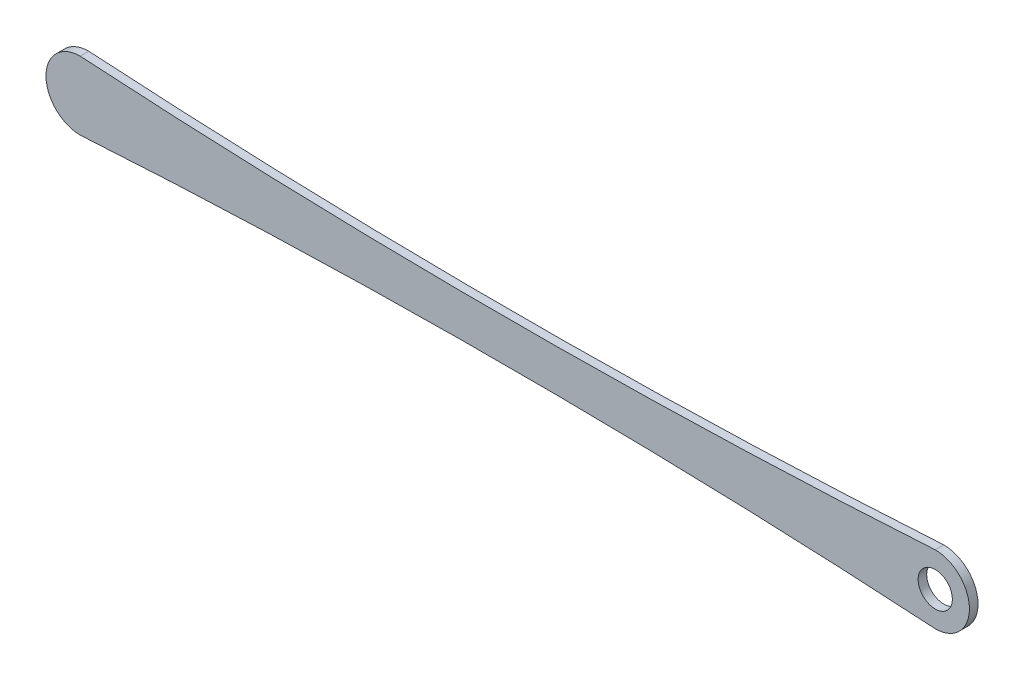
ISO-10303-21;
HEADER;
FILE_DESCRIPTION(('STEP AP214'),'2;1');
FILE_NAME('part.step','',(''),(''),'','','');
FILE_SCHEMA(('AUTOMOTIVE_DESIGN { 1 0 10303 214 1 1 1 1 }'));
ENDSEC;
DATA;
#1=APPLICATION_CONTEXT('core data for automotive mechanical design processes');
#2=APPLICATION_PROTOCOL_DEFINITION('international standard','automotive_design',2000,#1);
#3=PRODUCT_CONTEXT('',#1,'mechanical');
#4=PRODUCT('Part','Part','',(#3));
#5=PRODUCT_RELATED_PRODUCT_CATEGORY('part','',(#4));
#6=PRODUCT_DEFINITION_FORMATION('','',#4);
#7=PRODUCT_DEFINITION_CONTEXT('part definition',#1,'design');
#8=PRODUCT_DEFINITION('design','',#6,#7);
#9=PRODUCT_DEFINITION_SHAPE('','',#8);
#10=(LENGTH_UNIT() NAMED_UNIT(*) SI_UNIT(.MILLI.,.METRE.));
#11=(NAMED_UNIT(*) PLANE_ANGLE_UNIT() SI_UNIT($,.RADIAN.));
#12=(NAMED_UNIT(*) SI_UNIT($,.STERADIAN.) SOLID_ANGLE_UNIT());
#13=UNCERTAINTY_MEASURE_WITH_UNIT(LENGTH_MEASURE(1.E-05),#10,'distance_accuracy_value','');
#14=(GEOMETRIC_REPRESENTATION_CONTEXT(3) GLOBAL_UNCERTAINTY_ASSIGNED_CONTEXT((#13)) GLOBAL_UNIT_ASSIGNED_CONTEXT((#10,
#11,#12)) REPRESENTATION_CONTEXT('',''));
#15=CARTESIAN_POINT('',(0.,0.,0.));
#16=DIRECTION('',(0.,0.,1.));
#17=DIRECTION('',(1.,0.,0.));
#18=AXIS2_PLACEMENT_3D('',#15,#16,#17);
#19=CARTESIAN_POINT('',(-9.97681353911284E-13,20060.8992783391,25.));
#20=DIRECTION('',(0.,0.,-1.));
#21=DIRECTION('',(-1.,0.,0.));
#22=AXIS2_PLACEMENT_3D('',#19,#20,#21);
#23=CYLINDRICAL_SURFACE('',#22,20000.);
#24=CARTESIAN_POINT('',(-9.97681353911284E-13,20060.8992783391,0.));
#25=DIRECTION('',(0.,0.,-1.));
#26=DIRECTION('',(1.,0.,0.));
#27=AXIS2_PLACEMENT_3D('',#24,#25,#26);
#28=CIRCLE('',#27,20000.);
#29=CARTESIAN_POINT('',(1250.,99.9999999999999,0.));
#30=VERTEX_POINT('',#29);
#31=CARTESIAN_POINT('',(-1250.,100.,0.));
#32=VERTEX_POINT('',#31);
#33=EDGE_CURVE('E101',#30,#32,#28,.T.);
#34=ORIENTED_EDGE('',*,*,#33,.T.);
#35=DIRECTION('',(0.,0.,-1.));
#36=VECTOR('',#35,1.);
#37=CARTESIAN_POINT('',(-1250.,100.,25.));
#38=LINE('',#37,#36);
#39=CARTESIAN_POINT('',(-1250.,100.,25.));
#40=VERTEX_POINT('',#39);
#41=EDGE_CURVE('E43',#40,#32,#38,.T.);
#42=ORIENTED_EDGE('',*,*,#41,.F.);
#43=CARTESIAN_POINT('',(-9.97681353911284E-13,20060.8992783391,25.));
#44=DIRECTION('',(0.,0.,-1.));
#45=DIRECTION('',(1.,0.,0.));
#46=AXIS2_PLACEMENT_3D('',#43,#44,#45);
#47=CIRCLE('',#46,20000.);
#48=CARTESIAN_POINT('',(1250.,99.9999999999999,25.));
#49=VERTEX_POINT('',#48);
#50=EDGE_CURVE('E87',#49,#40,#47,.T.);
#51=ORIENTED_EDGE('',*,*,#50,.F.);
#52=DIRECTION('',(0.,0.,-1.));
#53=VECTOR('',#52,1.);
#54=CARTESIAN_POINT('',(1250.,99.9999999999999,25.));
#55=LINE('',#54,#53);
#56=EDGE_CURVE('E97',#49,#30,#55,.T.);
#57=ORIENTED_EDGE('',*,*,#56,.T.);
#58=EDGE_LOOP('',(#34,#42,#51,#57));
#59=FACE_BOUND('',#58,.T.);
#60=ADVANCED_FACE('F35',(#59),#23,.F.);
#61=CARTESIAN_POINT('',(-1250.,0.,25.));
#62=DIRECTION('',(0.,0.,-1.));
#63=DIRECTION('',(-1.,0.,0.));
#64=AXIS2_PLACEMENT_3D('',#61,#62,#63);
#65=CYLINDRICAL_SURFACE('',#64,100.);
#66=CARTESIAN_POINT('',(-1250.,0.,0.));
#67=DIRECTION('',(0.,0.,1.));
#68=DIRECTION('',(1.,0.,0.));
#69=AXIS2_PLACEMENT_3D('',#66,#67,#68);
#70=CIRCLE('',#69,100.);
#71=CARTESIAN_POINT('',(-1250.,-100.000000000001,0.));
#72=VERTEX_POINT('',#71);
#73=EDGE_CURVE('E92',#32,#72,#70,.T.);
#74=ORIENTED_EDGE('',*,*,#73,.T.);
#75=DIRECTION('',(0.,0.,-1.));
#76=VECTOR('',#75,1.);
#77=CARTESIAN_POINT('',(-1250.,-100.000000000001,25.));
#78=LINE('',#77,#76);
#79=CARTESIAN_POINT('',(-1250.,-100.000000000001,25.));
#80=VERTEX_POINT('',#79);
#81=EDGE_CURVE('E90',#80,#72,#78,.T.);
#82=ORIENTED_EDGE('',*,*,#81,.F.);
#83=CARTESIAN_POINT('',(-1250.,0.,25.));
#84=DIRECTION('',(0.,0.,1.));
#85=DIRECTION('',(1.,0.,0.));
#86=AXIS2_PLACEMENT_3D('',#83,#84,#85);
#87=CIRCLE('',#86,100.);
#88=EDGE_CURVE('E82',#40,#80,#87,.T.);
#89=ORIENTED_EDGE('',*,*,#88,.F.);
#90=ORIENTED_EDGE('',*,*,#41,.T.);
#91=EDGE_LOOP('',(#74,#82,#89,#90));
#92=FACE_BOUND('',#91,.T.);
#93=ADVANCED_FACE('F91',(#92),#65,.T.);
#94=CARTESIAN_POINT('',(-9.97681353911284E-13,-20060.8992783391,25.));
#95=DIRECTION('',(0.,0.,-1.));
#96=DIRECTION('',(-1.,0.,0.));
#97=AXIS2_PLACEMENT_3D('',#94,#95,#96);
#98=CYLINDRICAL_SURFACE('',#97,20000.);
#99=CARTESIAN_POINT('',(-9.97681353911284E-13,-20060.8992783391,0.));
#100=DIRECTION('',(0.,0.,-1.));
#101=DIRECTION('',(-1.,0.,0.));
#102=AXIS2_PLACEMENT_3D('',#99,#100,#101);
#103=CIRCLE('',#102,20000.);
#104=CARTESIAN_POINT('',(1250.,-100.,0.));
#105=VERTEX_POINT('',#104);
#106=EDGE_CURVE('E68',#72,#105,#103,.T.);
#107=ORIENTED_EDGE('',*,*,#106,.T.);
#108=DIRECTION('',(0.,0.,-1.));
#109=VECTOR('',#108,1.);
#110=CARTESIAN_POINT('',(1250.,-100.,25.));
#111=LINE('',#110,#109);
#112=CARTESIAN_POINT('',(1250.,-100.,25.));
#113=VERTEX_POINT('',#112);
#114=EDGE_CURVE('E93',#113,#105,#111,.T.);
#115=ORIENTED_EDGE('',*,*,#114,.F.);
#116=CARTESIAN_POINT('',(-9.97681353911284E-13,-20060.8992783391,25.));
#117=DIRECTION('',(0.,0.,-1.));
#118=DIRECTION('',(-1.,0.,0.));
#119=AXIS2_PLACEMENT_3D('',#116,#117,#118);
#120=CIRCLE('',#119,20000.);
#121=EDGE_CURVE('E85',#80,#113,#120,.T.);
#122=ORIENTED_EDGE('',*,*,#121,.F.);
#123=ORIENTED_EDGE('',*,*,#81,.T.);
#124=EDGE_LOOP('',(#107,#115,#122,#123));
#125=FACE_BOUND('',#124,.T.);
#126=ADVANCED_FACE('F95',(#125),#98,.F.);
#127=CARTESIAN_POINT('',(1250.,0.,25.));
#128=DIRECTION('',(0.,0.,-1.));
#129=DIRECTION('',(-1.,0.,0.));
#130=AXIS2_PLACEMENT_3D('',#127,#128,#129);
#131=CYLINDRICAL_SURFACE('',#130,99.9999999999999);
#132=CARTESIAN_POINT('',(1250.,0.,0.));
#133=DIRECTION('',(0.,0.,1.));
#134=DIRECTION('',(1.,0.,0.));
#135=AXIS2_PLACEMENT_3D('',#132,#133,#134);
#136=CIRCLE('',#135,99.9999999999999);
#137=EDGE_CURVE('E74',#105,#30,#136,.T.);
#138=ORIENTED_EDGE('',*,*,#137,.T.);
#139=ORIENTED_EDGE('',*,*,#56,.F.);
#140=CARTESIAN_POINT('',(1250.,0.,25.));
#141=DIRECTION('',(0.,0.,1.));
#142=DIRECTION('',(1.,0.,0.));
#143=AXIS2_PLACEMENT_3D('',#140,#141,#142);
#144=CIRCLE('',#143,99.9999999999999);
#145=EDGE_CURVE('E51',#113,#49,#144,.T.);
#146=ORIENTED_EDGE('',*,*,#145,.F.);
#147=ORIENTED_EDGE('',*,*,#114,.T.);
#148=EDGE_LOOP('',(#138,#139,#146,#147));
#149=FACE_BOUND('',#148,.T.);
#150=ADVANCED_FACE('F124',(#149),#131,.T.);
#151=CARTESIAN_POINT('',(624.999999999999,10030.4496391696,25.));
#152=DIRECTION('',(0.,0.,1.));
#153=DIRECTION('',(1.,0.,0.));
#154=AXIS2_PLACEMENT_3D('',#151,#152,#153);
#155=PLANE('',#154);
#156=CARTESIAN_POINT('',(1250.,0.,25.));
#157=DIRECTION('',(0.,0.,1.));
#158=DIRECTION('',(-1.,0.,0.));
#159=AXIS2_PLACEMENT_3D('',#156,#157,#158);
#160=CIRCLE('',#159,50.);
#161=CARTESIAN_POINT('',(1200.,0.,25.));
#162=VERTEX_POINT('',#161);
#163=EDGE_CURVE('E184',#162,#162,#160,.T.);
#164=ORIENTED_EDGE('',*,*,#163,.F.);
#165=EDGE_LOOP('',(#164));
#166=FACE_BOUND('',#165,.T.);
#167=ORIENTED_EDGE('',*,*,#50,.T.);
#168=ORIENTED_EDGE('',*,*,#88,.T.);
#169=ORIENTED_EDGE('',*,*,#121,.T.);
#170=ORIENTED_EDGE('',*,*,#145,.T.);
#171=EDGE_LOOP('',(#167,#168,#169,#170));
#172=FACE_BOUND('',#171,.T.);
#173=ADVANCED_FACE('F83',(#166,#172),#155,.T.);
#174=CARTESIAN_POINT('',(624.999999999999,10030.4496391696,0.));
#175=DIRECTION('',(0.,0.,1.));
#176=DIRECTION('',(1.,0.,0.));
#177=AXIS2_PLACEMENT_3D('',#174,#175,#176);
#178=PLANE('',#177);
#179=CARTESIAN_POINT('',(1250.,0.,0.));
#180=DIRECTION('',(0.,0.,1.));
#181=DIRECTION('',(-1.,0.,0.));
#182=AXIS2_PLACEMENT_3D('',#179,#180,#181);
#183=CIRCLE('',#182,50.);
#184=CARTESIAN_POINT('',(1200.,0.,0.));
#185=VERTEX_POINT('',#184);
#186=EDGE_CURVE('E182',#185,#185,#183,.T.);
#187=ORIENTED_EDGE('',*,*,#186,.T.);
#188=EDGE_LOOP('',(#187));
#189=FACE_BOUND('',#188,.T.);
#190=CARTESIAN_POINT('',(-1250.,0.,0.));
#191=DIRECTION('',(0.,0.,1.));
#192=DIRECTION('',(1.,0.,0.));
#193=AXIS2_PLACEMENT_3D('',#190,#191,#192);
#194=CIRCLE('',#193,50.);
#195=CARTESIAN_POINT('',(-1200.,0.,0.));
#196=VERTEX_POINT('',#195);
#197=EDGE_CURVE('E11',#196,#196,#194,.F.);
#198=ORIENTED_EDGE('',*,*,#197,.F.);
#199=EDGE_LOOP('',(#198));
#200=FACE_BOUND('',#199,.T.);
#201=ORIENTED_EDGE('',*,*,#33,.F.);
#202=ORIENTED_EDGE('',*,*,#137,.F.);
#203=ORIENTED_EDGE('',*,*,#106,.F.);
#204=ORIENTED_EDGE('',*,*,#73,.F.);
#205=EDGE_LOOP('',(#201,#202,#203,#204));
#206=FACE_BOUND('',#205,.T.);
#207=ADVANCED_FACE('F112',(#189,#200,#206),#178,.F.);
#208=CARTESIAN_POINT('',(-1250.,0.,-25.));
#209=DIRECTION('',(0.,0.,1.));
#210=DIRECTION('',(0.,-1.,0.));
#211=AXIS2_PLACEMENT_3D('',#208,#209,#210);
#212=CYLINDRICAL_SURFACE('',#211,50.);
#213=CARTESIAN_POINT('',(-1250.,0.,-25.));
#214=DIRECTION('',(0.,0.,-1.));
#215=DIRECTION('',(0.,1.,0.));
#216=AXIS2_PLACEMENT_3D('',#213,#214,#215);
#217=CIRCLE('',#216,50.);
#218=CARTESIAN_POINT('',(-1250.,50.,-25.));
#219=VERTEX_POINT('',#218);
#220=EDGE_CURVE('E104',#219,#219,#217,.T.);
#221=ORIENTED_EDGE('',*,*,#220,.F.);
#222=EDGE_LOOP('',(#221));
#223=FACE_BOUND('',#222,.T.);
#224=ORIENTED_EDGE('',*,*,#197,.T.);
#225=EDGE_LOOP('',(#224));
#226=FACE_BOUND('',#225,.T.);
#227=ADVANCED_FACE('F114',(#223,#226),#212,.T.);
#228=CARTESIAN_POINT('',(-1250.,0.,-25.));
#229=DIRECTION('',(0.,0.,-1.));
#230=DIRECTION('',(0.,1.,0.));
#231=AXIS2_PLACEMENT_3D('',#228,#229,#230);
#232=PLANE('',#231);
#233=ORIENTED_EDGE('',*,*,#220,.T.);
#234=EDGE_LOOP('',(#233));
#235=FACE_BOUND('',#234,.T.);
#236=ADVANCED_FACE('F121',(#235),#232,.T.);
#237=CARTESIAN_POINT('',(1250.,0.,0.));
#238=DIRECTION('',(0.,0.,1.));
#239=DIRECTION('',(1.,0.,0.));
#240=AXIS2_PLACEMENT_3D('',#237,#238,#239);
#241=CYLINDRICAL_SURFACE('',#240,50.);
#242=ORIENTED_EDGE('',*,*,#186,.F.);
#243=EDGE_LOOP('',(#242));
#244=FACE_BOUND('',#243,.T.);
#245=ORIENTED_EDGE('',*,*,#163,.T.);
#246=EDGE_LOOP('',(#245));
#247=FACE_BOUND('',#246,.T.);
#248=ADVANCED_FACE('F162',(#244,#247),#241,.F.);
#249=CLOSED_SHELL('',(#60,#93,#126,#150,#173,#207,#227,#236,#248));
#250=MANIFOLD_SOLID_BREP('B2',#249);
#251=ADVANCED_BREP_SHAPE_REPRESENTATION('',(#18,#250),#14);
#252=SHAPE_DEFINITION_REPRESENTATION(#9,#251);
ENDSEC;
END-ISO-10303-21;
